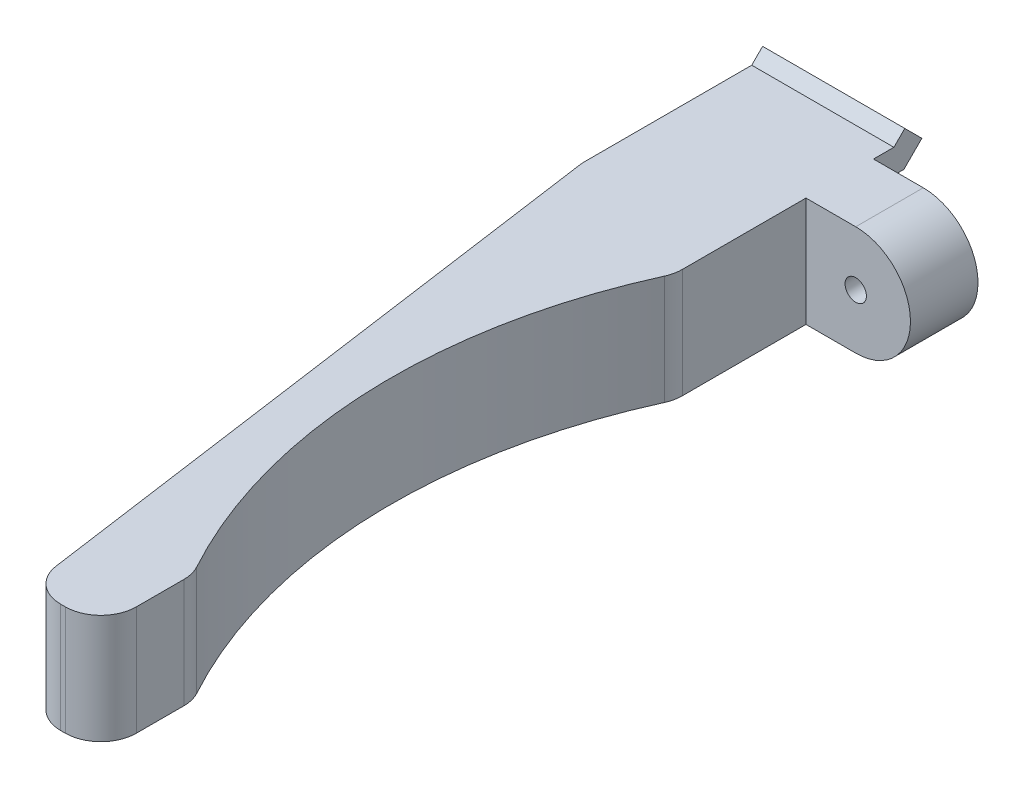
ISO-10303-21;
HEADER;
FILE_DESCRIPTION(('STEP AP214'),'2;1');
FILE_NAME('part.step','',(''),(''),'','','');
FILE_SCHEMA(('AUTOMOTIVE_DESIGN { 1 0 10303 214 1 1 1 1 }'));
ENDSEC;
DATA;
#1=APPLICATION_CONTEXT('core data for automotive mechanical design processes');
#2=APPLICATION_PROTOCOL_DEFINITION('international standard','automotive_design',2000,#1);
#3=PRODUCT_CONTEXT('',#1,'mechanical');
#4=PRODUCT('Part','Part','',(#3));
#5=PRODUCT_RELATED_PRODUCT_CATEGORY('part','',(#4));
#6=PRODUCT_DEFINITION_FORMATION('','',#4);
#7=PRODUCT_DEFINITION_CONTEXT('part definition',#1,'design');
#8=PRODUCT_DEFINITION('design','',#6,#7);
#9=PRODUCT_DEFINITION_SHAPE('','',#8);
#10=(LENGTH_UNIT() NAMED_UNIT(*) SI_UNIT(.MILLI.,.METRE.));
#11=(NAMED_UNIT(*) PLANE_ANGLE_UNIT() SI_UNIT($,.RADIAN.));
#12=(NAMED_UNIT(*) SI_UNIT($,.STERADIAN.) SOLID_ANGLE_UNIT());
#13=UNCERTAINTY_MEASURE_WITH_UNIT(LENGTH_MEASURE(1.E-05),#10,'distance_accuracy_value','');
#14=(GEOMETRIC_REPRESENTATION_CONTEXT(3) GLOBAL_UNCERTAINTY_ASSIGNED_CONTEXT((#13)) GLOBAL_UNIT_ASSIGNED_CONTEXT((#10,
#11,#12)) REPRESENTATION_CONTEXT('',''));
#15=CARTESIAN_POINT('',(0.,0.,0.));
#16=DIRECTION('',(0.,0.,1.));
#17=DIRECTION('',(1.,0.,0.));
#18=AXIS2_PLACEMENT_3D('',#15,#16,#17);
#19=CARTESIAN_POINT('',(5.,-5.8181568544759,5.));
#20=DIRECTION('',(-1.,0.,0.));
#21=DIRECTION('',(0.,0.,1.));
#22=AXIS2_PLACEMENT_3D('',#19,#20,#21);
#23=PLANE('',#22);
#24=DIRECTION('',(0.,0.,1.));
#25=VECTOR('',#24,1.);
#26=CARTESIAN_POINT('',(5.,5.77025558493694,-0.150000000000024));
#27=LINE('',#26,#25);
#28=CARTESIAN_POINT('',(5.,5.77025558493694,-1.4337049096098));
#29=VERTEX_POINT('',#28);
#30=CARTESIAN_POINT('',(5.,5.77025558493694,0.));
#31=VERTEX_POINT('',#30);
#32=EDGE_CURVE('E331',#29,#31,#27,.T.);
#33=ORIENTED_EDGE('',*,*,#32,.T.);
#34=DIRECTION('',(0.,-1.,0.));
#35=VECTOR('',#34,1.);
#36=CARTESIAN_POINT('',(5.,-1.92974441504038,0.));
#37=LINE('',#36,#35);
#38=CARTESIAN_POINT('',(5.,4.07025558493702,0.));
#39=VERTEX_POINT('',#38);
#40=EDGE_CURVE('E219',#31,#39,#37,.T.);
#41=ORIENTED_EDGE('',*,*,#40,.T.);
#42=DIRECTION('',(0.,-5.31981865966135E-13,-1.));
#43=VECTOR('',#42,1.);
#44=CARTESIAN_POINT('',(5.,4.07025558493702,0.));
#45=LINE('',#44,#43);
#46=CARTESIAN_POINT('',(5.,4.07025558493694,-2.13786796564406));
#47=VERTEX_POINT('',#46);
#48=EDGE_CURVE('E304',#39,#47,#45,.T.);
#49=ORIENTED_EDGE('',*,*,#48,.T.);
#50=DIRECTION('',(0.,0.707106781186548,-0.707106781186547));
#51=VECTOR('',#50,1.);
#52=CARTESIAN_POINT('',(5.,5.33446914731004,-3.40208152801715));
#53=LINE('',#52,#51);
#54=CARTESIAN_POINT('',(5.,5.33446914731004,-3.40208152801715));
#55=VERTEX_POINT('',#54);
#56=EDGE_CURVE('E302',#47,#55,#53,.T.);
#57=ORIENTED_EDGE('',*,*,#56,.T.);
#58=DIRECTION('',(0.,0.707106781186546,0.707106781186549));
#59=VECTOR('',#58,1.);
#60=CARTESIAN_POINT('',(5.,6.53655067532716,-2.20000000000002));
#61=LINE('',#60,#59);
#62=CARTESIAN_POINT('',(5.,6.53655067532716,-2.20000000000002));
#63=VERTEX_POINT('',#62);
#64=EDGE_CURVE('E299',#55,#63,#61,.T.);
#65=ORIENTED_EDGE('',*,*,#64,.T.);
#66=DIRECTION('',(0.,-0.707106781186548,0.707106781186547));
#67=VECTOR('',#66,1.);
#68=CARTESIAN_POINT('',(5.,5.77025558493694,-1.4337049096098));
#69=LINE('',#68,#67);
#70=EDGE_CURVE('E297',#63,#29,#69,.T.);
#71=ORIENTED_EDGE('',*,*,#70,.T.);
#72=EDGE_LOOP('',(#33,#41,#49,#57,#65,#71));
#73=FACE_BOUND('',#72,.T.);
#74=ADVANCED_FACE('F40',(#73),#23,.F.);
#75=DIRECTION('',(0.,0.,1.));
#76=VECTOR('',#75,1.);
#77=CARTESIAN_POINT('',(5.,-0.229744415063062,-0.150000000000024));
#78=LINE('',#77,#76);
#79=CARTESIAN_POINT('',(5.,-0.229744415063062,-1.4337049096098));
#80=VERTEX_POINT('',#79);
#81=CARTESIAN_POINT('',(5.,-0.229744415063062,0.));
#82=VERTEX_POINT('',#81);
#83=EDGE_CURVE('E216',#80,#82,#78,.T.);
#84=ORIENTED_EDGE('',*,*,#83,.T.);
#85=CARTESIAN_POINT('',(5.,-1.92974441504038,0.));
#86=VERTEX_POINT('',#85);
#87=EDGE_CURVE('E213',#82,#86,#37,.T.);
#88=ORIENTED_EDGE('',*,*,#87,.T.);
#89=DIRECTION('',(0.,-4.06214413957837E-13,-1.));
#90=VECTOR('',#89,1.);
#91=CARTESIAN_POINT('',(5.,-1.92974441506306,-0.150000000000024));
#92=LINE('',#91,#90);
#93=CARTESIAN_POINT('',(5.,-1.92974441506306,-2.13786796564406));
#94=VERTEX_POINT('',#93);
#95=EDGE_CURVE('E196',#86,#94,#92,.T.);
#96=ORIENTED_EDGE('',*,*,#95,.T.);
#97=DIRECTION('',(0.,0.707106781186549,-0.707106781186546));
#98=VECTOR('',#97,1.);
#99=CARTESIAN_POINT('',(5.,-0.665530852689966,-3.40208152801715));
#100=LINE('',#99,#98);
#101=CARTESIAN_POINT('',(5.,-0.665530852689966,-3.40208152801715));
#102=VERTEX_POINT('',#101);
#103=EDGE_CURVE('E209',#94,#102,#100,.T.);
#104=ORIENTED_EDGE('',*,*,#103,.T.);
#105=DIRECTION('',(0.,0.707106781186548,0.707106781186548));
#106=VECTOR('',#105,1.);
#107=CARTESIAN_POINT('',(5.,0.536550675327164,-2.20000000000002));
#108=LINE('',#107,#106);
#109=CARTESIAN_POINT('',(5.,0.536550675327164,-2.20000000000002));
#110=VERTEX_POINT('',#109);
#111=EDGE_CURVE('E270',#102,#110,#108,.T.);
#112=ORIENTED_EDGE('',*,*,#111,.T.);
#113=DIRECTION('',(0.,-0.707106781186546,0.707106781186549));
#114=VECTOR('',#113,1.);
#115=CARTESIAN_POINT('',(5.,-0.229744415063062,-1.4337049096098));
#116=LINE('',#115,#114);
#117=EDGE_CURVE('E268',#110,#80,#116,.T.);
#118=ORIENTED_EDGE('',*,*,#117,.T.);
#119=EDGE_LOOP('',(#84,#88,#96,#104,#112,#118));
#120=FACE_BOUND('',#119,.T.);
#121=ADVANCED_FACE('F214',(#120),#23,.F.);
#122=CARTESIAN_POINT('',(5.,5.77025558493694,4.75000000000266));
#123=VERTEX_POINT('',#122);
#124=CARTESIAN_POINT('',(5.,5.77025558493694,13.4501334916828));
#125=VERTEX_POINT('',#124);
#126=EDGE_CURVE('E306',#123,#125,#27,.T.);
#127=ORIENTED_EDGE('',*,*,#126,.T.);
#128=DIRECTION('',(0.,-1.,0.));
#129=VECTOR('',#128,1.);
#130=CARTESIAN_POINT('',(5.,-1.92974441505733,13.4501334916828));
#131=LINE('',#130,#129);
#132=CARTESIAN_POINT('',(5.,-1.92974441505754,13.4501334916828));
#133=VERTEX_POINT('',#132);
#134=EDGE_CURVE('E360',#125,#133,#131,.T.);
#135=ORIENTED_EDGE('',*,*,#134,.T.);
#136=CARTESIAN_POINT('',(5.,-1.92974441506107,4.75000000000266));
#137=VERTEX_POINT('',#136);
#138=EDGE_CURVE('E208',#133,#137,#92,.T.);
#139=ORIENTED_EDGE('',*,*,#138,.T.);
#140=DIRECTION('',(0.,-1.,0.));
#141=VECTOR('',#140,1.);
#142=CARTESIAN_POINT('',(5.,-1.92974441504038,4.75000000000266));
#143=LINE('',#142,#141);
#144=EDGE_CURVE('E424',#123,#137,#143,.T.);
#145=ORIENTED_EDGE('',*,*,#144,.F.);
#146=EDGE_LOOP('',(#127,#135,#139,#145));
#147=FACE_BOUND('',#146,.T.);
#148=ADVANCED_FACE('F450',(#147),#23,.F.);
#149=CARTESIAN_POINT('',(-5.,-5.8181568544759,5.));
#150=DIRECTION('',(1.,0.,0.));
#151=DIRECTION('',(0.,0.,-1.));
#152=AXIS2_PLACEMENT_3D('',#149,#150,#151);
#153=PLANE('',#152);
#154=DIRECTION('',(0.,4.06214413957837E-13,1.));
#155=VECTOR('',#154,1.);
#156=CARTESIAN_POINT('',(-5.,-1.92974441506306,-0.150000000000024));
#157=LINE('',#156,#155);
#158=CARTESIAN_POINT('',(-5.,-1.92974441506306,-2.13786796564406));
#159=VERTEX_POINT('',#158);
#160=CARTESIAN_POINT('',(-5.,-1.92974441505874,10.5));
#161=VERTEX_POINT('',#160);
#162=EDGE_CURVE('E284',#159,#161,#157,.T.);
#163=ORIENTED_EDGE('',*,*,#162,.T.);
#164=DIRECTION('',(0.,1.,0.));
#165=VECTOR('',#164,1.);
#166=CARTESIAN_POINT('',(-5.,-53.8851870945201,10.5));
#167=LINE('',#166,#165);
#168=CARTESIAN_POINT('',(-5.,5.77025558493694,10.5));
#169=VERTEX_POINT('',#168);
#170=EDGE_CURVE('E263',#161,#169,#167,.T.);
#171=ORIENTED_EDGE('',*,*,#170,.T.);
#172=DIRECTION('',(0.,0.,-1.));
#173=VECTOR('',#172,1.);
#174=CARTESIAN_POINT('',(-5.,5.77025558493694,-0.150000000000024));
#175=LINE('',#174,#173);
#176=CARTESIAN_POINT('',(-5.,5.77025558493694,-1.4337049096098));
#177=VERTEX_POINT('',#176);
#178=EDGE_CURVE('E296',#169,#177,#175,.T.);
#179=ORIENTED_EDGE('',*,*,#178,.T.);
#180=DIRECTION('',(0.,0.707106781186548,-0.707106781186547));
#181=VECTOR('',#180,1.);
#182=CARTESIAN_POINT('',(-5.,5.77025558493694,-1.4337049096098));
#183=LINE('',#182,#181);
#184=CARTESIAN_POINT('',(-5.,6.53655067532716,-2.20000000000002));
#185=VERTEX_POINT('',#184);
#186=EDGE_CURVE('E309',#177,#185,#183,.T.);
#187=ORIENTED_EDGE('',*,*,#186,.T.);
#188=DIRECTION('',(0.,-0.707106781186546,-0.707106781186549));
#189=VECTOR('',#188,1.);
#190=CARTESIAN_POINT('',(-5.,6.53655067532716,-2.20000000000002));
#191=LINE('',#190,#189);
#192=CARTESIAN_POINT('',(-5.,5.33446914731004,-3.40208152801715));
#193=VERTEX_POINT('',#192);
#194=EDGE_CURVE('E312',#185,#193,#191,.T.);
#195=ORIENTED_EDGE('',*,*,#194,.T.);
#196=DIRECTION('',(0.,-0.707106781186548,0.707106781186547));
#197=VECTOR('',#196,1.);
#198=CARTESIAN_POINT('',(-5.,5.33446914731004,-3.40208152801715));
#199=LINE('',#198,#197);
#200=CARTESIAN_POINT('',(-5.,4.07025558493694,-2.13786796564406));
#201=VERTEX_POINT('',#200);
#202=EDGE_CURVE('E315',#193,#201,#199,.T.);
#203=ORIENTED_EDGE('',*,*,#202,.T.);
#204=DIRECTION('',(0.,5.31981865966135E-13,1.));
#205=VECTOR('',#204,1.);
#206=CARTESIAN_POINT('',(-5.,4.07025558493702,0.));
#207=LINE('',#206,#205);
#208=CARTESIAN_POINT('',(-5.,4.07025558493702,0.));
#209=VERTEX_POINT('',#208);
#210=EDGE_CURVE('E318',#201,#209,#207,.T.);
#211=ORIENTED_EDGE('',*,*,#210,.T.);
#212=DIRECTION('',(0.,-1.,0.));
#213=VECTOR('',#212,1.);
#214=CARTESIAN_POINT('',(-5.,-5.8181568544759,0.));
#215=LINE('',#214,#213);
#216=CARTESIAN_POINT('',(-5.,-0.229744415063002,0.));
#217=VERTEX_POINT('',#216);
#218=EDGE_CURVE('E333',#209,#217,#215,.T.);
#219=ORIENTED_EDGE('',*,*,#218,.T.);
#220=DIRECTION('',(0.,0.,-1.));
#221=VECTOR('',#220,1.);
#222=CARTESIAN_POINT('',(-5.,-0.229744415063062,-0.150000000000024));
#223=LINE('',#222,#221);
#224=CARTESIAN_POINT('',(-5.,-0.229744415063062,-1.4337049096098));
#225=VERTEX_POINT('',#224);
#226=EDGE_CURVE('E260',#217,#225,#223,.T.);
#227=ORIENTED_EDGE('',*,*,#226,.T.);
#228=DIRECTION('',(0.,0.707106781186546,-0.707106781186549));
#229=VECTOR('',#228,1.);
#230=CARTESIAN_POINT('',(-5.,-0.229744415063062,-1.4337049096098));
#231=LINE('',#230,#229);
#232=CARTESIAN_POINT('',(-5.,0.536550675327164,-2.20000000000002));
#233=VERTEX_POINT('',#232);
#234=EDGE_CURVE('E275',#225,#233,#231,.T.);
#235=ORIENTED_EDGE('',*,*,#234,.T.);
#236=DIRECTION('',(0.,-0.707106781186548,-0.707106781186548));
#237=VECTOR('',#236,1.);
#238=CARTESIAN_POINT('',(-5.,0.536550675327164,-2.20000000000002));
#239=LINE('',#238,#237);
#240=CARTESIAN_POINT('',(-5.,-0.665530852689966,-3.40208152801715));
#241=VERTEX_POINT('',#240);
#242=EDGE_CURVE('E278',#233,#241,#239,.T.);
#243=ORIENTED_EDGE('',*,*,#242,.T.);
#244=DIRECTION('',(0.,-0.707106781186549,0.707106781186546));
#245=VECTOR('',#244,1.);
#246=CARTESIAN_POINT('',(-5.,-0.665530852689966,-3.40208152801715));
#247=LINE('',#246,#245);
#248=EDGE_CURVE('E281',#241,#159,#247,.T.);
#249=ORIENTED_EDGE('',*,*,#248,.T.);
#250=EDGE_LOOP('',(#163,#171,#179,#187,#195,#203,#211,#219,#227,#235,#243,#249));
#251=FACE_BOUND('',#250,.T.);
#252=ADVANCED_FACE('F381',(#251),#153,.F.);
#253=CARTESIAN_POINT('',(0.,0.,0.));
#254=DIRECTION('',(0.,0.,-1.));
#255=DIRECTION('',(-1.,0.,0.));
#256=AXIS2_PLACEMENT_3D('',#253,#254,#255);
#257=PLANE('',#256);
#258=DIRECTION('',(-1.,0.,0.));
#259=VECTOR('',#258,1.);
#260=CARTESIAN_POINT('',(9.20199597764663,-0.229744415063002,0.));
#261=LINE('',#260,#259);
#262=EDGE_CURVE('E286',#82,#217,#261,.T.);
#263=ORIENTED_EDGE('',*,*,#262,.T.);
#264=ORIENTED_EDGE('',*,*,#218,.F.);
#265=DIRECTION('',(-1.,0.,0.));
#266=VECTOR('',#265,1.);
#267=CARTESIAN_POINT('',(9.20199597764663,4.07025558493702,0.));
#268=LINE('',#267,#266);
#269=EDGE_CURVE('E300',#39,#209,#268,.T.);
#270=ORIENTED_EDGE('',*,*,#269,.F.);
#271=ORIENTED_EDGE('',*,*,#40,.F.);
#272=DIRECTION('',(-1.,0.,0.));
#273=VECTOR('',#272,1.);
#274=CARTESIAN_POINT('',(5.,5.77025558493694,0.));
#275=LINE('',#274,#273);
#276=CARTESIAN_POINT('',(8.5,5.77025558493694,0.));
#277=VERTEX_POINT('',#276);
#278=EDGE_CURVE('E228',#277,#31,#275,.T.);
#279=ORIENTED_EDGE('',*,*,#278,.F.);
#280=CARTESIAN_POINT('',(8.5,1.92025558494828,0.));
#281=DIRECTION('',(0.,0.,1.));
#282=DIRECTION('',(-1.,0.,0.));
#283=AXIS2_PLACEMENT_3D('',#280,#281,#282);
#284=CIRCLE('',#283,3.84999999998866);
#285=CARTESIAN_POINT('',(8.5,-1.92974441504038,0.));
#286=VERTEX_POINT('',#285);
#287=EDGE_CURVE('E226',#286,#277,#284,.T.);
#288=ORIENTED_EDGE('',*,*,#287,.F.);
#289=DIRECTION('',(1.,0.,0.));
#290=VECTOR('',#289,1.);
#291=CARTESIAN_POINT('',(8.5,-1.92974441504038,0.));
#292=LINE('',#291,#290);
#293=EDGE_CURVE('E202',#86,#286,#292,.T.);
#294=ORIENTED_EDGE('',*,*,#293,.F.);
#295=ORIENTED_EDGE('',*,*,#87,.F.);
#296=EDGE_LOOP('',(#263,#264,#270,#271,#279,#288,#294,#295));
#297=FACE_BOUND('',#296,.T.);
#298=CARTESIAN_POINT('',(8.5,1.92025558494828,0.));
#299=DIRECTION('',(0.,0.,1.));
#300=DIRECTION('',(1.,0.,0.));
#301=AXIS2_PLACEMENT_3D('',#298,#299,#300);
#302=CIRCLE('',#301,0.74999999999913);
#303=CARTESIAN_POINT('',(9.24999999999913,1.92025558494828,0.));
#304=VERTEX_POINT('',#303);
#305=EDGE_CURVE('E220',#304,#304,#302,.T.);
#306=ORIENTED_EDGE('',*,*,#305,.T.);
#307=EDGE_LOOP('',(#306));
#308=FACE_BOUND('',#307,.T.);
#309=ADVANCED_FACE('F222',(#297,#308),#257,.T.);
#310=CARTESIAN_POINT('',(9.20199597764663,4.07025558493702,0.));
#311=DIRECTION('',(0.,-1.,5.31981865966135E-13));
#312=DIRECTION('',(0.,-5.31981865966135E-13,-1.));
#313=AXIS2_PLACEMENT_3D('',#310,#311,#312);
#314=PLANE('',#313);
#315=ORIENTED_EDGE('',*,*,#48,.F.);
#316=ORIENTED_EDGE('',*,*,#269,.T.);
#317=ORIENTED_EDGE('',*,*,#210,.F.);
#318=DIRECTION('',(-1.,0.,0.));
#319=VECTOR('',#318,1.);
#320=CARTESIAN_POINT('',(9.20199597764663,4.07025558493694,-2.13786796564406));
#321=LINE('',#320,#319);
#322=EDGE_CURVE('E324',#47,#201,#321,.T.);
#323=ORIENTED_EDGE('',*,*,#322,.F.);
#324=EDGE_LOOP('',(#315,#316,#317,#323));
#325=FACE_BOUND('',#324,.T.);
#326=ADVANCED_FACE('F403',(#325),#314,.T.);
#327=CARTESIAN_POINT('',(9.20199597764663,5.33446914731004,-3.40208152801715));
#328=DIRECTION('',(0.,-0.707106781186547,-0.707106781186548));
#329=DIRECTION('',(0.,0.707106781186548,-0.707106781186547));
#330=AXIS2_PLACEMENT_3D('',#327,#328,#329);
#331=PLANE('',#330);
#332=ORIENTED_EDGE('',*,*,#56,.F.);
#333=ORIENTED_EDGE('',*,*,#322,.T.);
#334=ORIENTED_EDGE('',*,*,#202,.F.);
#335=DIRECTION('',(-1.,0.,0.));
#336=VECTOR('',#335,1.);
#337=CARTESIAN_POINT('',(9.20199597764663,5.33446914731004,-3.40208152801715));
#338=LINE('',#337,#336);
#339=EDGE_CURVE('E326',#55,#193,#338,.T.);
#340=ORIENTED_EDGE('',*,*,#339,.F.);
#341=EDGE_LOOP('',(#332,#333,#334,#340));
#342=FACE_BOUND('',#341,.T.);
#343=ADVANCED_FACE('F635',(#342),#331,.T.);
#344=CARTESIAN_POINT('',(9.20199597764663,6.53655067532716,-2.20000000000002));
#345=DIRECTION('',(0.,0.707106781186549,-0.707106781186546));
#346=DIRECTION('',(0.,0.707106781186546,0.707106781186549));
#347=AXIS2_PLACEMENT_3D('',#344,#345,#346);
#348=PLANE('',#347);
#349=ORIENTED_EDGE('',*,*,#64,.F.);
#350=ORIENTED_EDGE('',*,*,#339,.T.);
#351=ORIENTED_EDGE('',*,*,#194,.F.);
#352=DIRECTION('',(-1.,0.,0.));
#353=VECTOR('',#352,1.);
#354=CARTESIAN_POINT('',(9.20199597764663,6.53655067532716,-2.20000000000002));
#355=LINE('',#354,#353);
#356=EDGE_CURVE('E328',#63,#185,#355,.T.);
#357=ORIENTED_EDGE('',*,*,#356,.F.);
#358=EDGE_LOOP('',(#349,#350,#351,#357));
#359=FACE_BOUND('',#358,.T.);
#360=ADVANCED_FACE('F626',(#359),#348,.T.);
#361=CARTESIAN_POINT('',(9.20199597764663,5.77025558493694,-1.4337049096098));
#362=DIRECTION('',(0.,0.707106781186547,0.707106781186548));
#363=DIRECTION('',(0.,-0.707106781186548,0.707106781186547));
#364=AXIS2_PLACEMENT_3D('',#361,#362,#363);
#365=PLANE('',#364);
#366=ORIENTED_EDGE('',*,*,#70,.F.);
#367=ORIENTED_EDGE('',*,*,#356,.T.);
#368=ORIENTED_EDGE('',*,*,#186,.F.);
#369=DIRECTION('',(-1.,0.,0.));
#370=VECTOR('',#369,1.);
#371=CARTESIAN_POINT('',(9.20199597764663,5.77025558493694,-1.4337049096098));
#372=LINE('',#371,#370);
#373=EDGE_CURVE('E321',#29,#177,#372,.T.);
#374=ORIENTED_EDGE('',*,*,#373,.F.);
#375=EDGE_LOOP('',(#366,#367,#368,#374));
#376=FACE_BOUND('',#375,.T.);
#377=ADVANCED_FACE('F530',(#376),#365,.T.);
#378=CARTESIAN_POINT('',(9.20199597764663,5.77025558493694,-0.150000000000024));
#379=DIRECTION('',(0.,1.,0.));
#380=DIRECTION('',(0.,0.,1.));
#381=AXIS2_PLACEMENT_3D('',#378,#379,#380);
#382=PLANE('',#381);
#383=DIRECTION('',(0.,0.,-1.));
#384=VECTOR('',#383,1.);
#385=CARTESIAN_POINT('',(6.35244572854812,5.77025558493694,55.7));
#386=LINE('',#385,#384);
#387=CARTESIAN_POINT('',(6.35244572854812,5.77025558493694,53.2));
#388=VERTEX_POINT('',#387);
#389=CARTESIAN_POINT('',(6.35244572854812,5.77025558493694,49.8497116646297));
#390=VERTEX_POINT('',#389);
#391=EDGE_CURVE('E250',#388,#390,#386,.T.);
#392=ORIENTED_EDGE('',*,*,#391,.T.);
#393=CARTESIAN_POINT('',(3.85244572854813,5.77025558493693,49.8497116646297));
#394=DIRECTION('',(0.,1.,0.));
#395=DIRECTION('',(0.,0.,1.));
#396=AXIS2_PLACEMENT_3D('',#393,#394,#395);
#397=CIRCLE('',#396,2.5);
#398=CARTESIAN_POINT('',(6.04589541498279,5.77025558493694,48.6502207421631));
#399=VERTEX_POINT('',#398);
#400=EDGE_CURVE('E347',#390,#399,#397,.T.);
#401=ORIENTED_EDGE('',*,*,#400,.T.);
#402=CARTESIAN_POINT('',(39.6088986863946,5.77025558493694,30.2962470888115));
#403=DIRECTION('',(0.,-1.,0.));
#404=DIRECTION('',(0.,0.,1.));
#405=AXIS2_PLACEMENT_3D('',#402,#403,#404);
#406=CIRCLE('',#405,38.2536735159477);
#407=CARTESIAN_POINT('',(4.77641433795368,5.77025558493694,14.4835442338173));
#408=VERTEX_POINT('',#407);
#409=EDGE_CURVE('E247',#399,#408,#406,.T.);
#410=ORIENTED_EDGE('',*,*,#409,.T.);
#411=CARTESIAN_POINT('',(2.5,5.77025558493693,13.4501334916828));
#412=DIRECTION('',(0.,1.,0.));
#413=DIRECTION('',(0.,0.,1.));
#414=AXIS2_PLACEMENT_3D('',#411,#412,#413);
#415=CIRCLE('',#414,2.5);
#416=EDGE_CURVE('E345',#408,#125,#415,.T.);
#417=ORIENTED_EDGE('',*,*,#416,.T.);
#418=ORIENTED_EDGE('',*,*,#126,.F.);
#419=DIRECTION('',(-1.,0.,0.));
#420=VECTOR('',#419,1.);
#421=CARTESIAN_POINT('',(5.,5.77025558493694,4.75000000000266));
#422=LINE('',#421,#420);
#423=CARTESIAN_POINT('',(8.5,5.77025558493694,4.75000000000266));
#424=VERTEX_POINT('',#423);
#425=EDGE_CURVE('E242',#424,#123,#422,.T.);
#426=ORIENTED_EDGE('',*,*,#425,.F.);
#427=DIRECTION('',(0.,0.,-1.));
#428=VECTOR('',#427,1.);
#429=CARTESIAN_POINT('',(8.5,5.77025558493694,17.3948344280003));
#430=LINE('',#429,#428);
#431=EDGE_CURVE('E234',#424,#277,#430,.T.);
#432=ORIENTED_EDGE('',*,*,#431,.T.);
#433=ORIENTED_EDGE('',*,*,#278,.T.);
#434=ORIENTED_EDGE('',*,*,#32,.F.);
#435=ORIENTED_EDGE('',*,*,#373,.T.);
#436=ORIENTED_EDGE('',*,*,#178,.F.);
#437=DIRECTION('',(0.139173100960066,0.,0.99026806874157));
#438=VECTOR('',#437,1.);
#439=CARTESIAN_POINT('',(-5.,5.77025558493694,10.5));
#440=LINE('',#439,#438);
#441=CARTESIAN_POINT('',(1.04999240123476,5.77025558493694,53.5479327524002));
#442=VERTEX_POINT('',#441);
#443=EDGE_CURVE('E243',#169,#442,#440,.T.);
#444=ORIENTED_EDGE('',*,*,#443,.T.);
#445=CARTESIAN_POINT('',(3.52566257308868,5.77025558493693,53.2));
#446=DIRECTION('',(0.,1.,0.));
#447=DIRECTION('',(0.,0.,1.));
#448=AXIS2_PLACEMENT_3D('',#445,#446,#447);
#449=CIRCLE('',#448,2.5);
#450=CARTESIAN_POINT('',(3.52566257308868,5.77025558493694,55.7));
#451=VERTEX_POINT('',#450);
#452=EDGE_CURVE('E341',#442,#451,#449,.T.);
#453=ORIENTED_EDGE('',*,*,#452,.T.);
#454=DIRECTION('',(1.,0.,0.));
#455=VECTOR('',#454,1.);
#456=CARTESIAN_POINT('',(1.35244572854812,5.77025558493694,55.7));
#457=LINE('',#456,#455);
#458=CARTESIAN_POINT('',(3.85244572854812,5.77025558493694,55.7));
#459=VERTEX_POINT('',#458);
#460=EDGE_CURVE('E238',#451,#459,#457,.T.);
#461=ORIENTED_EDGE('',*,*,#460,.T.);
#462=CARTESIAN_POINT('',(3.85244572854812,5.77025558493693,53.2));
#463=DIRECTION('',(0.,1.,0.));
#464=DIRECTION('',(0.,0.,1.));
#465=AXIS2_PLACEMENT_3D('',#462,#463,#464);
#466=CIRCLE('',#465,2.5);
#467=EDGE_CURVE('E343',#459,#388,#466,.T.);
#468=ORIENTED_EDGE('',*,*,#467,.T.);
#469=EDGE_LOOP('',(#392,#401,#410,#417,#418,#426,#432,#433,#434,#435,#436,#444,#453,#461,#468));
#470=FACE_BOUND('',#469,.T.);
#471=ADVANCED_FACE('F371',(#470),#382,.T.);
#472=CARTESIAN_POINT('',(9.20199597764663,-1.92974441506306,-0.150000000000024));
#473=DIRECTION('',(0.,-1.,4.06214413957837E-13));
#474=DIRECTION('',(0.,-4.06214413957837E-13,-1.));
#475=AXIS2_PLACEMENT_3D('',#472,#473,#474);
#476=PLANE('',#475);
#477=CARTESIAN_POINT('',(39.6088986863946,-1.9297444150507,30.2962470888115));
#478=DIRECTION('',(0.,-1.,4.06214413957837E-13));
#479=DIRECTION('',(0.,-4.06214413957837E-13,-1.));
#480=AXIS2_PLACEMENT_3D('',#477,#478,#479);
#481=CIRCLE('',#480,38.2536735159477);
#482=CARTESIAN_POINT('',(6.04589541498279,-1.92974441504324,48.6502207421631));
#483=VERTEX_POINT('',#482);
#484=CARTESIAN_POINT('',(4.77641433795368,-1.92974441505712,14.4835442338173));
#485=VERTEX_POINT('',#484);
#486=EDGE_CURVE('E257',#483,#485,#481,.T.);
#487=ORIENTED_EDGE('',*,*,#486,.F.);
#488=CARTESIAN_POINT('',(3.85244572854813,-1.92974441504275,49.8497116646297));
#489=DIRECTION('',(0.,-1.,4.06214413957837E-13));
#490=DIRECTION('',(0.,-4.06214413957837E-13,-1.));
#491=AXIS2_PLACEMENT_3D('',#488,#489,#490);
#492=CIRCLE('',#491,2.5);
#493=CARTESIAN_POINT('',(6.35244572854812,-1.92974441504275,49.8497116646297));
#494=VERTEX_POINT('',#493);
#495=EDGE_CURVE('E358',#483,#494,#492,.T.);
#496=ORIENTED_EDGE('',*,*,#495,.T.);
#497=DIRECTION('',(0.,-4.06214413957837E-13,-1.));
#498=VECTOR('',#497,1.);
#499=CARTESIAN_POINT('',(6.35244572854812,-1.92974441504037,55.6999999999789));
#500=LINE('',#499,#498);
#501=CARTESIAN_POINT('',(6.35244572854812,-1.92974441504139,53.2));
#502=VERTEX_POINT('',#501);
#503=EDGE_CURVE('E246',#502,#494,#500,.T.);
#504=ORIENTED_EDGE('',*,*,#503,.F.);
#505=CARTESIAN_POINT('',(3.85244572854812,-1.92974441504139,53.2));
#506=DIRECTION('',(0.,-1.,4.06214413957837E-13));
#507=DIRECTION('',(0.,-4.06214413957837E-13,-1.));
#508=AXIS2_PLACEMENT_3D('',#505,#506,#507);
#509=CIRCLE('',#508,2.5);
#510=CARTESIAN_POINT('',(3.85244572854812,-1.92974441504037,55.7));
#511=VERTEX_POINT('',#510);
#512=EDGE_CURVE('E61',#502,#511,#509,.T.);
#513=ORIENTED_EDGE('',*,*,#512,.T.);
#514=DIRECTION('',(1.,0.,0.));
#515=VECTOR('',#514,1.);
#516=CARTESIAN_POINT('',(1.35244572854812,-1.92974441504037,55.7));
#517=LINE('',#516,#515);
#518=CARTESIAN_POINT('',(3.52566257308868,-1.92974441504037,55.7));
#519=VERTEX_POINT('',#518);
#520=EDGE_CURVE('E258',#519,#511,#517,.T.);
#521=ORIENTED_EDGE('',*,*,#520,.F.);
#522=CARTESIAN_POINT('',(3.52566257308868,-1.92974441504139,53.2));
#523=DIRECTION('',(0.,-1.,4.06214413957837E-13));
#524=DIRECTION('',(0.,-4.06214413957837E-13,-1.));
#525=AXIS2_PLACEMENT_3D('',#522,#523,#524);
#526=CIRCLE('',#525,2.5);
#527=CARTESIAN_POINT('',(1.04999240123476,-1.92974441504125,53.5479327524002));
#528=VERTEX_POINT('',#527);
#529=EDGE_CURVE('E55',#519,#528,#526,.T.);
#530=ORIENTED_EDGE('',*,*,#529,.T.);
#531=DIRECTION('',(0.139173100960066,4.02261163205016E-13,0.99026806874157));
#532=VECTOR('',#531,1.);
#533=CARTESIAN_POINT('',(-5.00000000000291,-1.92974441505874,10.4999999999793));
#534=LINE('',#533,#532);
#535=EDGE_CURVE('E261',#161,#528,#534,.T.);
#536=ORIENTED_EDGE('',*,*,#535,.F.);
#537=ORIENTED_EDGE('',*,*,#162,.F.);
#538=DIRECTION('',(-1.,0.,0.));
#539=VECTOR('',#538,1.);
#540=CARTESIAN_POINT('',(9.20199597764663,-1.92974441506306,-2.13786796564406));
#541=LINE('',#540,#539);
#542=EDGE_CURVE('E205',#94,#159,#541,.T.);
#543=ORIENTED_EDGE('',*,*,#542,.F.);
#544=ORIENTED_EDGE('',*,*,#95,.F.);
#545=ORIENTED_EDGE('',*,*,#293,.T.);
#546=DIRECTION('',(0.,0.,-1.));
#547=VECTOR('',#546,1.);
#548=CARTESIAN_POINT('',(8.5,-1.92974441504038,17.3948344280003));
#549=LINE('',#548,#547);
#550=CARTESIAN_POINT('',(8.5,-1.92974441504038,4.75000000000266));
#551=VERTEX_POINT('',#550);
#552=EDGE_CURVE('E236',#551,#286,#549,.T.);
#553=ORIENTED_EDGE('',*,*,#552,.F.);
#554=DIRECTION('',(1.,0.,0.));
#555=VECTOR('',#554,1.);
#556=CARTESIAN_POINT('',(8.5,-1.92974441504038,4.75000000000266));
#557=LINE('',#556,#555);
#558=EDGE_CURVE('E420',#137,#551,#557,.T.);
#559=ORIENTED_EDGE('',*,*,#558,.F.);
#560=ORIENTED_EDGE('',*,*,#138,.F.);
#561=CARTESIAN_POINT('',(2.5,-1.92974441505754,13.4501334916828));
#562=DIRECTION('',(0.,-1.,4.06214413957837E-13));
#563=DIRECTION('',(0.,-4.06214413957837E-13,-1.));
#564=AXIS2_PLACEMENT_3D('',#561,#562,#563);
#565=CIRCLE('',#564,2.5);
#566=EDGE_CURVE('E356',#133,#485,#565,.T.);
#567=ORIENTED_EDGE('',*,*,#566,.T.);
#568=EDGE_LOOP('',(#487,#496,#504,#513,#521,#530,#536,#537,#543,#544,#545,#553,#559,#560,#567));
#569=FACE_BOUND('',#568,.T.);
#570=ADVANCED_FACE('F199',(#569),#476,.T.);
#571=CARTESIAN_POINT('',(9.20199597764663,-0.665530852689966,-3.40208152801715));
#572=DIRECTION('',(0.,-0.707106781186546,-0.707106781186549));
#573=DIRECTION('',(0.,0.707106781186549,-0.707106781186546));
#574=AXIS2_PLACEMENT_3D('',#571,#572,#573);
#575=PLANE('',#574);
#576=ORIENTED_EDGE('',*,*,#103,.F.);
#577=ORIENTED_EDGE('',*,*,#542,.T.);
#578=ORIENTED_EDGE('',*,*,#248,.F.);
#579=DIRECTION('',(-1.,0.,0.));
#580=VECTOR('',#579,1.);
#581=CARTESIAN_POINT('',(9.20199597764663,-0.665530852689966,-3.40208152801715));
#582=LINE('',#581,#580);
#583=EDGE_CURVE('E288',#102,#241,#582,.T.);
#584=ORIENTED_EDGE('',*,*,#583,.F.);
#585=EDGE_LOOP('',(#576,#577,#578,#584));
#586=FACE_BOUND('',#585,.T.);
#587=ADVANCED_FACE('F385',(#586),#575,.T.);
#588=CARTESIAN_POINT('',(9.20199597764663,0.536550675327164,-2.20000000000002));
#589=DIRECTION('',(0.,0.707106781186547,-0.707106781186547));
#590=DIRECTION('',(0.,0.707106781186548,0.707106781186548));
#591=AXIS2_PLACEMENT_3D('',#588,#589,#590);
#592=PLANE('',#591);
#593=ORIENTED_EDGE('',*,*,#111,.F.);
#594=ORIENTED_EDGE('',*,*,#583,.T.);
#595=ORIENTED_EDGE('',*,*,#242,.F.);
#596=DIRECTION('',(-1.,0.,0.));
#597=VECTOR('',#596,1.);
#598=CARTESIAN_POINT('',(9.20199597764663,0.536550675327164,-2.20000000000002));
#599=LINE('',#598,#597);
#600=EDGE_CURVE('E290',#110,#233,#599,.T.);
#601=ORIENTED_EDGE('',*,*,#600,.F.);
#602=EDGE_LOOP('',(#593,#594,#595,#601));
#603=FACE_BOUND('',#602,.T.);
#604=ADVANCED_FACE('F390',(#603),#592,.T.);
#605=CARTESIAN_POINT('',(9.20199597764663,-0.229744415063062,-1.4337049096098));
#606=DIRECTION('',(0.,0.707106781186549,0.707106781186546));
#607=DIRECTION('',(0.,-0.707106781186546,0.707106781186549));
#608=AXIS2_PLACEMENT_3D('',#605,#606,#607);
#609=PLANE('',#608);
#610=ORIENTED_EDGE('',*,*,#117,.F.);
#611=ORIENTED_EDGE('',*,*,#600,.T.);
#612=ORIENTED_EDGE('',*,*,#234,.F.);
#613=DIRECTION('',(-1.,0.,0.));
#614=VECTOR('',#613,1.);
#615=CARTESIAN_POINT('',(9.20199597764663,-0.229744415063062,-1.4337049096098));
#616=LINE('',#615,#614);
#617=EDGE_CURVE('E292',#80,#225,#616,.T.);
#618=ORIENTED_EDGE('',*,*,#617,.F.);
#619=EDGE_LOOP('',(#610,#611,#612,#618));
#620=FACE_BOUND('',#619,.T.);
#621=ADVANCED_FACE('F393',(#620),#609,.T.);
#622=CARTESIAN_POINT('',(9.20199597764663,-0.229744415063062,-0.150000000000024));
#623=DIRECTION('',(0.,1.,0.));
#624=DIRECTION('',(0.,0.,1.));
#625=AXIS2_PLACEMENT_3D('',#622,#623,#624);
#626=PLANE('',#625);
#627=ORIENTED_EDGE('',*,*,#83,.F.);
#628=ORIENTED_EDGE('',*,*,#617,.T.);
#629=ORIENTED_EDGE('',*,*,#226,.F.);
#630=ORIENTED_EDGE('',*,*,#262,.F.);
#631=EDGE_LOOP('',(#627,#628,#629,#630));
#632=FACE_BOUND('',#631,.T.);
#633=ADVANCED_FACE('F396',(#632),#626,.T.);
#634=CARTESIAN_POINT('',(6.35244572854812,-53.8851870945201,55.7));
#635=DIRECTION('',(1.,0.,0.));
#636=DIRECTION('',(0.,0.,-1.));
#637=AXIS2_PLACEMENT_3D('',#634,#635,#636);
#638=PLANE('',#637);
#639=ORIENTED_EDGE('',*,*,#503,.T.);
#640=DIRECTION('',(0.,1.,0.));
#641=VECTOR('',#640,1.);
#642=CARTESIAN_POINT('',(6.35244572854812,-53.8851870945201,49.8497116646297));
#643=LINE('',#642,#641);
#644=EDGE_CURVE('E338',#494,#390,#643,.T.);
#645=ORIENTED_EDGE('',*,*,#644,.T.);
#646=ORIENTED_EDGE('',*,*,#391,.F.);
#647=DIRECTION('',(0.,1.,0.));
#648=VECTOR('',#647,1.);
#649=CARTESIAN_POINT('',(6.35244572854812,-53.8851870945201,53.2));
#650=LINE('',#649,#648);
#651=EDGE_CURVE('E336',#388,#502,#650,.F.);
#652=ORIENTED_EDGE('',*,*,#651,.T.);
#653=EDGE_LOOP('',(#639,#645,#646,#652));
#654=FACE_BOUND('',#653,.T.);
#655=ADVANCED_FACE('F472',(#654),#638,.T.);
#656=CARTESIAN_POINT('',(39.6088986863946,-53.8851870945201,30.2962470888115));
#657=DIRECTION('',(0.,1.,0.));
#658=DIRECTION('',(0.,0.,1.));
#659=AXIS2_PLACEMENT_3D('',#656,#657,#658);
#660=CYLINDRICAL_SURFACE('',#659,38.2536735159477);
#661=ORIENTED_EDGE('',*,*,#409,.F.);
#662=DIRECTION('',(0.,1.,0.));
#663=VECTOR('',#662,1.);
#664=CARTESIAN_POINT('',(6.04589541498279,-53.8851870945201,48.6502207421631));
#665=LINE('',#664,#663);
#666=EDGE_CURVE('E352',#399,#483,#665,.F.);
#667=ORIENTED_EDGE('',*,*,#666,.T.);
#668=ORIENTED_EDGE('',*,*,#486,.T.);
#669=DIRECTION('',(0.,1.,0.));
#670=VECTOR('',#669,1.);
#671=CARTESIAN_POINT('',(4.77641433795368,-53.8851870945201,14.4835442338173));
#672=LINE('',#671,#670);
#673=EDGE_CURVE('E349',#485,#408,#672,.T.);
#674=ORIENTED_EDGE('',*,*,#673,.T.);
#675=EDGE_LOOP('',(#661,#667,#668,#674));
#676=FACE_BOUND('',#675,.T.);
#677=ADVANCED_FACE('F468',(#676),#660,.F.);
#678=CARTESIAN_POINT('',(-5.,-53.8851870945201,10.5));
#679=DIRECTION('',(-0.99026806874157,0.,0.139173100960066));
#680=DIRECTION('',(0.139173100960066,0.,0.99026806874157));
#681=AXIS2_PLACEMENT_3D('',#678,#679,#680);
#682=PLANE('',#681);
#683=ORIENTED_EDGE('',*,*,#535,.T.);
#684=DIRECTION('',(0.,1.,0.));
#685=VECTOR('',#684,1.);
#686=CARTESIAN_POINT('',(1.04999240123476,-53.8851870945201,53.5479327524002));
#687=LINE('',#686,#685);
#688=EDGE_CURVE('E12',#528,#442,#687,.T.);
#689=ORIENTED_EDGE('',*,*,#688,.T.);
#690=ORIENTED_EDGE('',*,*,#443,.F.);
#691=ORIENTED_EDGE('',*,*,#170,.F.);
#692=EDGE_LOOP('',(#683,#689,#690,#691));
#693=FACE_BOUND('',#692,.T.);
#694=ADVANCED_FACE('F377',(#693),#682,.T.);
#695=CARTESIAN_POINT('',(1.35244572854812,-53.8851870945201,55.7));
#696=DIRECTION('',(0.,0.,1.));
#697=DIRECTION('',(1.,0.,0.));
#698=AXIS2_PLACEMENT_3D('',#695,#696,#697);
#699=PLANE('',#698);
#700=ORIENTED_EDGE('',*,*,#520,.T.);
#701=DIRECTION('',(0.,1.,0.));
#702=VECTOR('',#701,1.);
#703=CARTESIAN_POINT('',(3.85244572854812,-53.8851870945201,55.7));
#704=LINE('',#703,#702);
#705=EDGE_CURVE('E48',#511,#459,#704,.T.);
#706=ORIENTED_EDGE('',*,*,#705,.T.);
#707=ORIENTED_EDGE('',*,*,#460,.F.);
#708=DIRECTION('',(0.,1.,0.));
#709=VECTOR('',#708,1.);
#710=CARTESIAN_POINT('',(3.52566257308868,-53.8851870945201,55.7));
#711=LINE('',#710,#709);
#712=EDGE_CURVE('E362',#451,#519,#711,.F.);
#713=ORIENTED_EDGE('',*,*,#712,.T.);
#714=EDGE_LOOP('',(#700,#706,#707,#713));
#715=FACE_BOUND('',#714,.T.);
#716=ADVANCED_FACE('F367',(#715),#699,.T.);
#717=CARTESIAN_POINT('',(8.5,1.92025558494828,17.3948344280003));
#718=DIRECTION('',(0.,0.,-1.));
#719=DIRECTION('',(-1.,0.,0.));
#720=AXIS2_PLACEMENT_3D('',#717,#718,#719);
#721=CYLINDRICAL_SURFACE('',#720,3.84999999998866);
#722=CARTESIAN_POINT('',(8.5,1.92025558494828,4.75000000000266));
#723=DIRECTION('',(0.,0.,1.));
#724=DIRECTION('',(1.,0.,0.));
#725=AXIS2_PLACEMENT_3D('',#722,#723,#724);
#726=CIRCLE('',#725,3.84999999998866);
#727=EDGE_CURVE('E416',#551,#424,#726,.T.);
#728=ORIENTED_EDGE('',*,*,#727,.F.);
#729=ORIENTED_EDGE('',*,*,#552,.T.);
#730=ORIENTED_EDGE('',*,*,#287,.T.);
#731=ORIENTED_EDGE('',*,*,#431,.F.);
#732=EDGE_LOOP('',(#728,#729,#730,#731));
#733=FACE_BOUND('',#732,.T.);
#734=ADVANCED_FACE('F415',(#733),#721,.T.);
#735=CARTESIAN_POINT('',(8.5,1.92025558494828,17.3948344280003));
#736=DIRECTION('',(0.,0.,-1.));
#737=DIRECTION('',(-1.,0.,0.));
#738=AXIS2_PLACEMENT_3D('',#735,#736,#737);
#739=CYLINDRICAL_SURFACE('',#738,0.74999999999913);
#740=ORIENTED_EDGE('',*,*,#305,.F.);
#741=EDGE_LOOP('',(#740));
#742=FACE_BOUND('',#741,.T.);
#743=CARTESIAN_POINT('',(8.5,1.92025558494828,4.75000000000266));
#744=DIRECTION('',(0.,0.,1.));
#745=DIRECTION('',(1.,0.,0.));
#746=AXIS2_PLACEMENT_3D('',#743,#744,#745);
#747=CIRCLE('',#746,0.74999999999913);
#748=CARTESIAN_POINT('',(9.24999999999913,1.92025558494828,4.75000000000266));
#749=VERTEX_POINT('',#748);
#750=EDGE_CURVE('E239',#749,#749,#747,.T.);
#751=ORIENTED_EDGE('',*,*,#750,.T.);
#752=EDGE_LOOP('',(#751));
#753=FACE_BOUND('',#752,.T.);
#754=ADVANCED_FACE('F432',(#742,#753),#739,.F.);
#755=CARTESIAN_POINT('',(0.,0.,4.75000000000266));
#756=DIRECTION('',(0.,0.,1.));
#757=DIRECTION('',(1.,0.,0.));
#758=AXIS2_PLACEMENT_3D('',#755,#756,#757);
#759=PLANE('',#758);
#760=ORIENTED_EDGE('',*,*,#750,.F.);
#761=EDGE_LOOP('',(#760));
#762=FACE_BOUND('',#761,.T.);
#763=ORIENTED_EDGE('',*,*,#425,.T.);
#764=ORIENTED_EDGE('',*,*,#144,.T.);
#765=ORIENTED_EDGE('',*,*,#558,.T.);
#766=ORIENTED_EDGE('',*,*,#727,.T.);
#767=EDGE_LOOP('',(#763,#764,#765,#766));
#768=FACE_BOUND('',#767,.T.);
#769=ADVANCED_FACE('F423',(#762,#768),#759,.T.);
#770=CARTESIAN_POINT('',(3.85244572854813,-53.8851870945201,49.8497116646297));
#771=DIRECTION('',(0.,1.,0.));
#772=DIRECTION('',(0.,0.,1.));
#773=AXIS2_PLACEMENT_3D('',#770,#771,#772);
#774=CYLINDRICAL_SURFACE('',#773,2.5);
#775=ORIENTED_EDGE('',*,*,#495,.F.);
#776=ORIENTED_EDGE('',*,*,#666,.F.);
#777=ORIENTED_EDGE('',*,*,#400,.F.);
#778=ORIENTED_EDGE('',*,*,#644,.F.);
#779=EDGE_LOOP('',(#775,#776,#777,#778));
#780=FACE_BOUND('',#779,.T.);
#781=ADVANCED_FACE('F439',(#780),#774,.T.);
#782=CARTESIAN_POINT('',(2.5,-53.8851870945201,13.4501334916828));
#783=DIRECTION('',(0.,1.,0.));
#784=DIRECTION('',(0.,0.,1.));
#785=AXIS2_PLACEMENT_3D('',#782,#783,#784);
#786=CYLINDRICAL_SURFACE('',#785,2.5);
#787=ORIENTED_EDGE('',*,*,#566,.F.);
#788=ORIENTED_EDGE('',*,*,#134,.F.);
#789=ORIENTED_EDGE('',*,*,#416,.F.);
#790=ORIENTED_EDGE('',*,*,#673,.F.);
#791=EDGE_LOOP('',(#787,#788,#789,#790));
#792=FACE_BOUND('',#791,.T.);
#793=ADVANCED_FACE('F445',(#792),#786,.T.);
#794=CARTESIAN_POINT('',(3.85244572854812,-53.8851870945201,53.2));
#795=DIRECTION('',(0.,1.,0.));
#796=DIRECTION('',(0.,0.,1.));
#797=AXIS2_PLACEMENT_3D('',#794,#795,#796);
#798=CYLINDRICAL_SURFACE('',#797,2.5);
#799=ORIENTED_EDGE('',*,*,#512,.F.);
#800=ORIENTED_EDGE('',*,*,#651,.F.);
#801=ORIENTED_EDGE('',*,*,#467,.F.);
#802=ORIENTED_EDGE('',*,*,#705,.F.);
#803=EDGE_LOOP('',(#799,#800,#801,#802));
#804=FACE_BOUND('',#803,.T.);
#805=ADVANCED_FACE('F474',(#804),#798,.T.);
#806=CARTESIAN_POINT('',(3.52566257308868,-53.8851870945201,53.2));
#807=DIRECTION('',(0.,1.,0.));
#808=DIRECTION('',(0.,0.,1.));
#809=AXIS2_PLACEMENT_3D('',#806,#807,#808);
#810=CYLINDRICAL_SURFACE('',#809,2.5);
#811=ORIENTED_EDGE('',*,*,#529,.F.);
#812=ORIENTED_EDGE('',*,*,#712,.F.);
#813=ORIENTED_EDGE('',*,*,#452,.F.);
#814=ORIENTED_EDGE('',*,*,#688,.F.);
#815=EDGE_LOOP('',(#811,#812,#813,#814));
#816=FACE_BOUND('',#815,.T.);
#817=ADVANCED_FACE('F42',(#816),#810,.T.);
#818=CLOSED_SHELL('',(#74,#121,#148,#252,#309,#326,#343,#360,#377,#471,#570,#587,#604,#621,#633,
#655,#677,#694,#716,#734,#754,#769,#781,#793,#805,#817));
#819=MANIFOLD_SOLID_BREP('B2',#818);
#820=ADVANCED_BREP_SHAPE_REPRESENTATION('',(#18,#819),#14);
#821=SHAPE_DEFINITION_REPRESENTATION(#9,#820);
ENDSEC;
END-ISO-10303-21;
